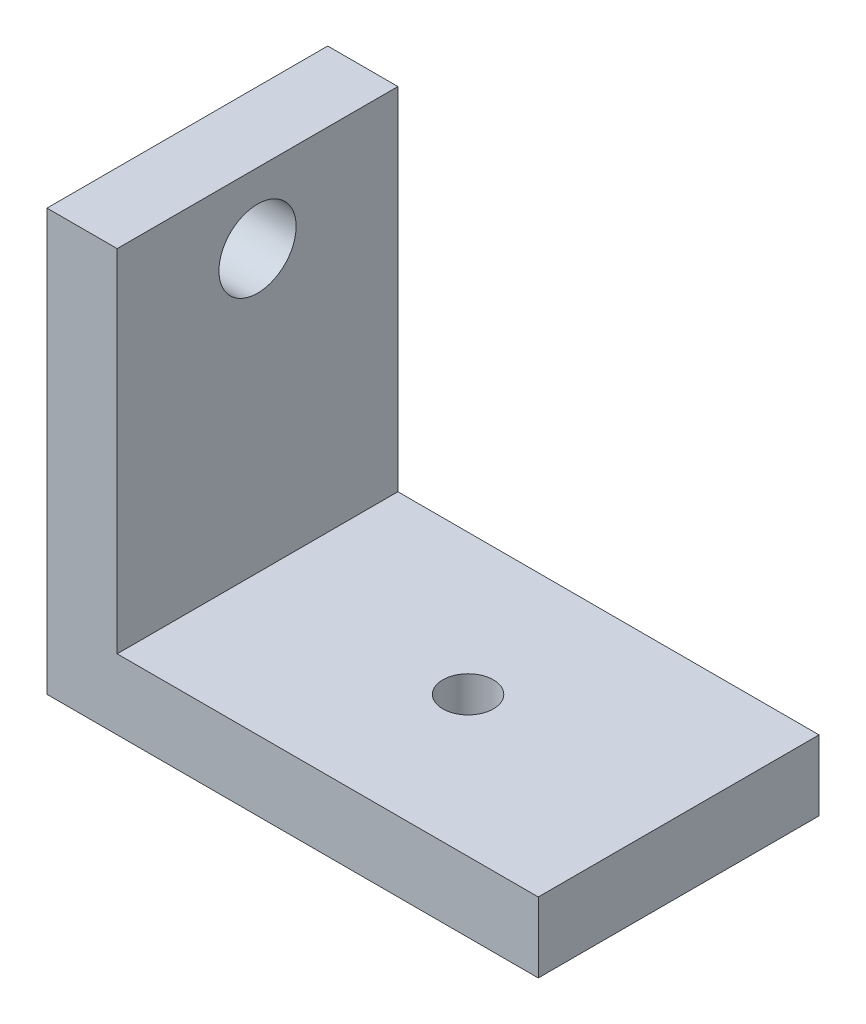
ISO-10303-21;
HEADER;
FILE_DESCRIPTION(('STEP AP214'),'2;1');
FILE_NAME('part.step','',(''),(''),'','','');
FILE_SCHEMA(('AUTOMOTIVE_DESIGN { 1 0 10303 214 1 1 1 1 }'));
ENDSEC;
DATA;
#1=APPLICATION_CONTEXT('core data for automotive mechanical design processes');
#2=APPLICATION_PROTOCOL_DEFINITION('international standard','automotive_design',2000,#1);
#3=PRODUCT_CONTEXT('',#1,'mechanical');
#4=PRODUCT('Part','Part','',(#3));
#5=PRODUCT_RELATED_PRODUCT_CATEGORY('part','',(#4));
#6=PRODUCT_DEFINITION_FORMATION('','',#4);
#7=PRODUCT_DEFINITION_CONTEXT('part definition',#1,'design');
#8=PRODUCT_DEFINITION('design','',#6,#7);
#9=PRODUCT_DEFINITION_SHAPE('','',#8);
#10=(LENGTH_UNIT() NAMED_UNIT(*) SI_UNIT(.MILLI.,.METRE.));
#11=(NAMED_UNIT(*) PLANE_ANGLE_UNIT() SI_UNIT($,.RADIAN.));
#12=(NAMED_UNIT(*) SI_UNIT($,.STERADIAN.) SOLID_ANGLE_UNIT());
#13=UNCERTAINTY_MEASURE_WITH_UNIT(LENGTH_MEASURE(1.E-05),#10,'distance_accuracy_value','');
#14=(GEOMETRIC_REPRESENTATION_CONTEXT(3) GLOBAL_UNCERTAINTY_ASSIGNED_CONTEXT((#13)) GLOBAL_UNIT_ASSIGNED_CONTEXT((#10,
#11,#12)) REPRESENTATION_CONTEXT('',''));
#15=CARTESIAN_POINT('',(0.,0.,0.));
#16=DIRECTION('',(0.,0.,1.));
#17=DIRECTION('',(1.,0.,0.));
#18=AXIS2_PLACEMENT_3D('',#15,#16,#17);
#19=CARTESIAN_POINT('',(5.,0.,0.));
#20=DIRECTION('',(1.,0.,0.));
#21=DIRECTION('',(0.,0.,-1.));
#22=AXIS2_PLACEMENT_3D('',#19,#20,#21);
#23=PLANE('',#22);
#24=DIRECTION('',(0.,0.,1.));
#25=VECTOR('',#24,1.);
#26=CARTESIAN_POINT('',(5.,-10.,-10.));
#27=LINE('',#26,#25);
#28=CARTESIAN_POINT('',(5.,-10.,-10.));
#29=VERTEX_POINT('',#28);
#30=CARTESIAN_POINT('',(5.,-10.,9.99999999999999));
#31=VERTEX_POINT('',#30);
#32=EDGE_CURVE('E50',#29,#31,#27,.T.);
#33=ORIENTED_EDGE('',*,*,#32,.F.);
#34=DIRECTION('',(0.,1.,0.));
#35=VECTOR('',#34,1.);
#36=CARTESIAN_POINT('',(5.,15.,-10.));
#37=LINE('',#36,#35);
#38=CARTESIAN_POINT('',(5.,15.,-10.));
#39=VERTEX_POINT('',#38);
#40=EDGE_CURVE('E87',#29,#39,#37,.T.);
#41=ORIENTED_EDGE('',*,*,#40,.T.);
#42=DIRECTION('',(0.,0.,1.));
#43=VECTOR('',#42,1.);
#44=CARTESIAN_POINT('',(5.,15.,9.99999999999999));
#45=LINE('',#44,#43);
#46=CARTESIAN_POINT('',(5.,15.,9.99999999999999));
#47=VERTEX_POINT('',#46);
#48=EDGE_CURVE('E56',#39,#47,#45,.T.);
#49=ORIENTED_EDGE('',*,*,#48,.T.);
#50=DIRECTION('',(0.,-1.,0.));
#51=VECTOR('',#50,1.);
#52=CARTESIAN_POINT('',(5.,15.,9.99999999999999));
#53=LINE('',#52,#51);
#54=EDGE_CURVE('E98',#47,#31,#53,.T.);
#55=ORIENTED_EDGE('',*,*,#54,.T.);
#56=EDGE_LOOP('',(#33,#41,#49,#55));
#57=FACE_BOUND('',#56,.T.);
#58=CARTESIAN_POINT('',(5.,10.,0.));
#59=DIRECTION('',(1.,0.,0.));
#60=DIRECTION('',(0.,0.,-1.));
#61=AXIS2_PLACEMENT_3D('',#58,#59,#60);
#62=CIRCLE('',#61,2.75);
#63=CARTESIAN_POINT('',(5.,10.,-2.75));
#64=VERTEX_POINT('',#63);
#65=EDGE_CURVE('E103',#64,#64,#62,.T.);
#66=ORIENTED_EDGE('',*,*,#65,.F.);
#67=EDGE_LOOP('',(#66));
#68=FACE_BOUND('',#67,.T.);
#69=ADVANCED_FACE('F35',(#57,#68),#23,.T.);
#70=CARTESIAN_POINT('',(0.,0.,0.));
#71=DIRECTION('',(1.,0.,0.));
#72=DIRECTION('',(0.,0.,-1.));
#73=AXIS2_PLACEMENT_3D('',#70,#71,#72);
#74=PLANE('',#73);
#75=DIRECTION('',(0.,1.,0.));
#76=VECTOR('',#75,1.);
#77=CARTESIAN_POINT('',(0.,15.,-10.));
#78=LINE('',#77,#76);
#79=CARTESIAN_POINT('',(0.,-15.,-10.));
#80=VERTEX_POINT('',#79);
#81=CARTESIAN_POINT('',(0.,15.,-10.));
#82=VERTEX_POINT('',#81);
#83=EDGE_CURVE('E93',#80,#82,#78,.T.);
#84=ORIENTED_EDGE('',*,*,#83,.F.);
#85=DIRECTION('',(0.,0.,-1.));
#86=VECTOR('',#85,1.);
#87=CARTESIAN_POINT('',(0.,-15.,9.99999999999999));
#88=LINE('',#87,#86);
#89=CARTESIAN_POINT('',(0.,-15.,9.99999999999999));
#90=VERTEX_POINT('',#89);
#91=EDGE_CURVE('E76',#90,#80,#88,.T.);
#92=ORIENTED_EDGE('',*,*,#91,.F.);
#93=DIRECTION('',(0.,-1.,0.));
#94=VECTOR('',#93,1.);
#95=CARTESIAN_POINT('',(0.,15.,9.99999999999999));
#96=LINE('',#95,#94);
#97=CARTESIAN_POINT('',(0.,15.,9.99999999999999));
#98=VERTEX_POINT('',#97);
#99=EDGE_CURVE('E88',#98,#90,#96,.T.);
#100=ORIENTED_EDGE('',*,*,#99,.F.);
#101=DIRECTION('',(0.,0.,1.));
#102=VECTOR('',#101,1.);
#103=CARTESIAN_POINT('',(0.,15.,9.99999999999999));
#104=LINE('',#103,#102);
#105=EDGE_CURVE('E102',#82,#98,#104,.T.);
#106=ORIENTED_EDGE('',*,*,#105,.F.);
#107=EDGE_LOOP('',(#84,#92,#100,#106));
#108=FACE_BOUND('',#107,.T.);
#109=CARTESIAN_POINT('',(0.,10.,0.));
#110=DIRECTION('',(1.,0.,0.));
#111=DIRECTION('',(0.,0.,-1.));
#112=AXIS2_PLACEMENT_3D('',#109,#110,#111);
#113=CIRCLE('',#112,2.75);
#114=CARTESIAN_POINT('',(0.,10.,-2.75));
#115=VERTEX_POINT('',#114);
#116=EDGE_CURVE('E107',#115,#115,#113,.T.);
#117=ORIENTED_EDGE('',*,*,#116,.T.);
#118=EDGE_LOOP('',(#117));
#119=FACE_BOUND('',#118,.T.);
#120=ADVANCED_FACE('F100',(#108,#119),#74,.F.);
#121=CARTESIAN_POINT('',(5.,15.,-10.));
#122=DIRECTION('',(0.,0.,1.));
#123=DIRECTION('',(0.,-1.,0.));
#124=AXIS2_PLACEMENT_3D('',#121,#122,#123);
#125=PLANE('',#124);
#126=ORIENTED_EDGE('',*,*,#83,.T.);
#127=DIRECTION('',(-1.,0.,0.));
#128=VECTOR('',#127,1.);
#129=CARTESIAN_POINT('',(5.,15.,-10.));
#130=LINE('',#129,#128);
#131=EDGE_CURVE('E11',#39,#82,#130,.T.);
#132=ORIENTED_EDGE('',*,*,#131,.F.);
#133=ORIENTED_EDGE('',*,*,#40,.F.);
#134=DIRECTION('',(-1.,0.,0.));
#135=VECTOR('',#134,1.);
#136=CARTESIAN_POINT('',(35.,-10.,-10.));
#137=LINE('',#136,#135);
#138=CARTESIAN_POINT('',(35.,-10.,-10.));
#139=VERTEX_POINT('',#138);
#140=EDGE_CURVE('E122',#139,#29,#137,.T.);
#141=ORIENTED_EDGE('',*,*,#140,.F.);
#142=DIRECTION('',(0.,1.,0.));
#143=VECTOR('',#142,1.);
#144=CARTESIAN_POINT('',(35.,-15.,-10.));
#145=LINE('',#144,#143);
#146=CARTESIAN_POINT('',(35.,-15.,-10.));
#147=VERTEX_POINT('',#146);
#148=EDGE_CURVE('E96',#147,#139,#145,.T.);
#149=ORIENTED_EDGE('',*,*,#148,.F.);
#150=DIRECTION('',(-1.,0.,0.));
#151=VECTOR('',#150,1.);
#152=CARTESIAN_POINT('',(5.,-15.,-10.));
#153=LINE('',#152,#151);
#154=EDGE_CURVE('E80',#147,#80,#153,.T.);
#155=ORIENTED_EDGE('',*,*,#154,.T.);
#156=EDGE_LOOP('',(#126,#132,#133,#141,#149,#155));
#157=FACE_BOUND('',#156,.T.);
#158=ADVANCED_FACE('F37',(#157),#125,.F.);
#159=CARTESIAN_POINT('',(5.,15.,9.99999999999999));
#160=DIRECTION('',(0.,-1.,0.));
#161=DIRECTION('',(0.,0.,-1.));
#162=AXIS2_PLACEMENT_3D('',#159,#160,#161);
#163=PLANE('',#162);
#164=ORIENTED_EDGE('',*,*,#105,.T.);
#165=DIRECTION('',(-1.,0.,0.));
#166=VECTOR('',#165,1.);
#167=CARTESIAN_POINT('',(5.,15.,9.99999999999999));
#168=LINE('',#167,#166);
#169=EDGE_CURVE('E43',#47,#98,#168,.T.);
#170=ORIENTED_EDGE('',*,*,#169,.F.);
#171=ORIENTED_EDGE('',*,*,#48,.F.);
#172=ORIENTED_EDGE('',*,*,#131,.T.);
#173=EDGE_LOOP('',(#164,#170,#171,#172));
#174=FACE_BOUND('',#173,.T.);
#175=ADVANCED_FACE('F119',(#174),#163,.F.);
#176=CARTESIAN_POINT('',(5.,15.,9.99999999999999));
#177=DIRECTION('',(0.,0.,-1.));
#178=DIRECTION('',(0.,1.,0.));
#179=AXIS2_PLACEMENT_3D('',#176,#177,#178);
#180=PLANE('',#179);
#181=ORIENTED_EDGE('',*,*,#99,.T.);
#182=DIRECTION('',(-1.,0.,0.));
#183=VECTOR('',#182,1.);
#184=CARTESIAN_POINT('',(5.,-15.,9.99999999999999));
#185=LINE('',#184,#183);
#186=CARTESIAN_POINT('',(35.,-15.,9.99999999999999));
#187=VERTEX_POINT('',#186);
#188=EDGE_CURVE('E83',#187,#90,#185,.T.);
#189=ORIENTED_EDGE('',*,*,#188,.F.);
#190=DIRECTION('',(0.,1.,0.));
#191=VECTOR('',#190,1.);
#192=CARTESIAN_POINT('',(35.,-15.,9.99999999999999));
#193=LINE('',#192,#191);
#194=CARTESIAN_POINT('',(35.,-10.,9.99999999999999));
#195=VERTEX_POINT('',#194);
#196=EDGE_CURVE('E142',#187,#195,#193,.T.);
#197=ORIENTED_EDGE('',*,*,#196,.T.);
#198=DIRECTION('',(-1.,0.,0.));
#199=VECTOR('',#198,1.);
#200=CARTESIAN_POINT('',(35.,-10.,9.99999999999999));
#201=LINE('',#200,#199);
#202=EDGE_CURVE('E131',#195,#31,#201,.T.);
#203=ORIENTED_EDGE('',*,*,#202,.T.);
#204=ORIENTED_EDGE('',*,*,#54,.F.);
#205=ORIENTED_EDGE('',*,*,#169,.T.);
#206=EDGE_LOOP('',(#181,#189,#197,#203,#204,#205));
#207=FACE_BOUND('',#206,.T.);
#208=ADVANCED_FACE('F116',(#207),#180,.F.);
#209=CARTESIAN_POINT('',(5.,-15.,9.99999999999999));
#210=DIRECTION('',(0.,1.,0.));
#211=DIRECTION('',(0.,0.,1.));
#212=AXIS2_PLACEMENT_3D('',#209,#210,#211);
#213=PLANE('',#212);
#214=CARTESIAN_POINT('',(20.,-15.,0.));
#215=DIRECTION('',(0.,1.,0.));
#216=DIRECTION('',(0.,0.,1.));
#217=AXIS2_PLACEMENT_3D('',#214,#215,#216);
#218=CIRCLE('',#217,1.8);
#219=CARTESIAN_POINT('',(20.,-15.,1.79999999999999));
#220=VERTEX_POINT('',#219);
#221=EDGE_CURVE('E153',#220,#220,#218,.T.);
#222=ORIENTED_EDGE('',*,*,#221,.T.);
#223=EDGE_LOOP('',(#222));
#224=FACE_BOUND('',#223,.T.);
#225=ORIENTED_EDGE('',*,*,#91,.T.);
#226=ORIENTED_EDGE('',*,*,#154,.F.);
#227=DIRECTION('',(0.,0.,1.));
#228=VECTOR('',#227,1.);
#229=CARTESIAN_POINT('',(35.,-15.,-10.));
#230=LINE('',#229,#228);
#231=EDGE_CURVE('E135',#147,#187,#230,.T.);
#232=ORIENTED_EDGE('',*,*,#231,.T.);
#233=ORIENTED_EDGE('',*,*,#188,.T.);
#234=EDGE_LOOP('',(#225,#226,#232,#233));
#235=FACE_BOUND('',#234,.T.);
#236=ADVANCED_FACE('F78',(#224,#235),#213,.F.);
#237=CARTESIAN_POINT('',(5.,10.,0.));
#238=DIRECTION('',(-1.,0.,0.));
#239=DIRECTION('',(0.,0.,1.));
#240=AXIS2_PLACEMENT_3D('',#237,#238,#239);
#241=CYLINDRICAL_SURFACE('',#240,2.75);
#242=ORIENTED_EDGE('',*,*,#65,.T.);
#243=EDGE_LOOP('',(#242));
#244=FACE_BOUND('',#243,.T.);
#245=ORIENTED_EDGE('',*,*,#116,.F.);
#246=EDGE_LOOP('',(#245));
#247=FACE_BOUND('',#246,.T.);
#248=ADVANCED_FACE('F167',(#244,#247),#241,.F.);
#249=CARTESIAN_POINT('',(35.,-10.,-10.));
#250=DIRECTION('',(0.,-1.,0.));
#251=DIRECTION('',(0.,0.,-1.));
#252=AXIS2_PLACEMENT_3D('',#249,#250,#251);
#253=PLANE('',#252);
#254=CARTESIAN_POINT('',(20.,-10.,0.));
#255=DIRECTION('',(0.,1.,0.));
#256=DIRECTION('',(0.,0.,1.));
#257=AXIS2_PLACEMENT_3D('',#254,#255,#256);
#258=CIRCLE('',#257,1.8);
#259=CARTESIAN_POINT('',(20.,-10.,1.79999999999999));
#260=VERTEX_POINT('',#259);
#261=EDGE_CURVE('E156',#260,#260,#258,.T.);
#262=ORIENTED_EDGE('',*,*,#261,.F.);
#263=EDGE_LOOP('',(#262));
#264=FACE_BOUND('',#263,.T.);
#265=ORIENTED_EDGE('',*,*,#32,.T.);
#266=ORIENTED_EDGE('',*,*,#202,.F.);
#267=DIRECTION('',(0.,0.,1.));
#268=VECTOR('',#267,1.);
#269=CARTESIAN_POINT('',(35.,-10.,-10.));
#270=LINE('',#269,#268);
#271=EDGE_CURVE('E130',#139,#195,#270,.T.);
#272=ORIENTED_EDGE('',*,*,#271,.F.);
#273=ORIENTED_EDGE('',*,*,#140,.T.);
#274=EDGE_LOOP('',(#265,#266,#272,#273));
#275=FACE_BOUND('',#274,.T.);
#276=ADVANCED_FACE('F126',(#264,#275),#253,.F.);
#277=CARTESIAN_POINT('',(35.,0.,0.));
#278=DIRECTION('',(1.,0.,0.));
#279=DIRECTION('',(0.,0.,-1.));
#280=AXIS2_PLACEMENT_3D('',#277,#278,#279);
#281=PLANE('',#280);
#282=ORIENTED_EDGE('',*,*,#148,.T.);
#283=ORIENTED_EDGE('',*,*,#271,.T.);
#284=ORIENTED_EDGE('',*,*,#196,.F.);
#285=ORIENTED_EDGE('',*,*,#231,.F.);
#286=EDGE_LOOP('',(#282,#283,#284,#285));
#287=FACE_BOUND('',#286,.T.);
#288=ADVANCED_FACE('F149',(#287),#281,.T.);
#289=CARTESIAN_POINT('',(20.,-15.,0.));
#290=DIRECTION('',(0.,1.,0.));
#291=DIRECTION('',(0.,0.,1.));
#292=AXIS2_PLACEMENT_3D('',#289,#290,#291);
#293=CYLINDRICAL_SURFACE('',#292,1.8);
#294=ORIENTED_EDGE('',*,*,#221,.F.);
#295=EDGE_LOOP('',(#294));
#296=FACE_BOUND('',#295,.T.);
#297=ORIENTED_EDGE('',*,*,#261,.T.);
#298=EDGE_LOOP('',(#297));
#299=FACE_BOUND('',#298,.T.);
#300=ADVANCED_FACE('F164',(#296,#299),#293,.F.);
#301=CLOSED_SHELL('',(#69,#120,#158,#175,#208,#236,#248,#276,#288,#300));
#302=MANIFOLD_SOLID_BREP('B2',#301);
#303=ADVANCED_BREP_SHAPE_REPRESENTATION('',(#18,#302),#14);
#304=SHAPE_DEFINITION_REPRESENTATION(#9,#303);
ENDSEC;
END-ISO-10303-21;
